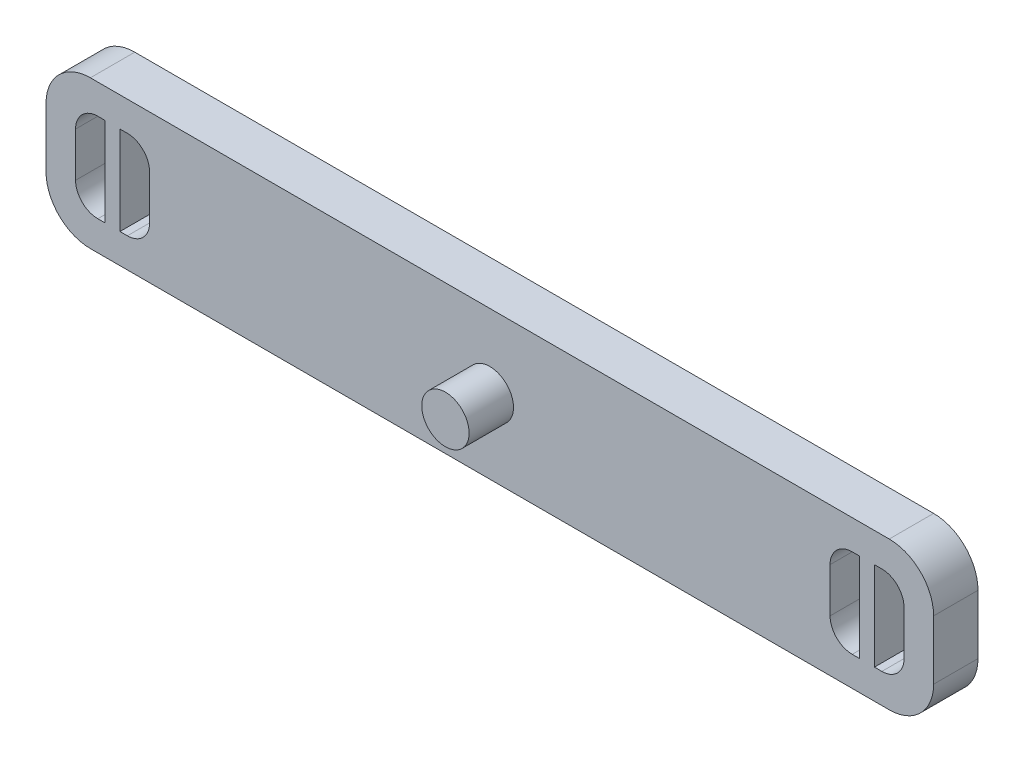
ISO-10303-21;
HEADER;
FILE_DESCRIPTION(('STEP AP214'),'2;1');
FILE_NAME('part.step','',(''),(''),'','','');
FILE_SCHEMA(('AUTOMOTIVE_DESIGN { 1 0 10303 214 1 1 1 1 }'));
ENDSEC;
DATA;
#1=APPLICATION_CONTEXT('core data for automotive mechanical design processes');
#2=APPLICATION_PROTOCOL_DEFINITION('international standard','automotive_design',2000,#1);
#3=PRODUCT_CONTEXT('',#1,'mechanical');
#4=PRODUCT('Part','Part','',(#3));
#5=PRODUCT_RELATED_PRODUCT_CATEGORY('part','',(#4));
#6=PRODUCT_DEFINITION_FORMATION('','',#4);
#7=PRODUCT_DEFINITION_CONTEXT('part definition',#1,'design');
#8=PRODUCT_DEFINITION('design','',#6,#7);
#9=PRODUCT_DEFINITION_SHAPE('','',#8);
#10=(LENGTH_UNIT() NAMED_UNIT(*) SI_UNIT(.MILLI.,.METRE.));
#11=(NAMED_UNIT(*) PLANE_ANGLE_UNIT() SI_UNIT($,.RADIAN.));
#12=(NAMED_UNIT(*) SI_UNIT($,.STERADIAN.) SOLID_ANGLE_UNIT());
#13=UNCERTAINTY_MEASURE_WITH_UNIT(LENGTH_MEASURE(1.E-05),#10,'distance_accuracy_value','');
#14=(GEOMETRIC_REPRESENTATION_CONTEXT(3) GLOBAL_UNCERTAINTY_ASSIGNED_CONTEXT((#13)) GLOBAL_UNIT_ASSIGNED_CONTEXT((#10,
#11,#12)) REPRESENTATION_CONTEXT('',''));
#15=CARTESIAN_POINT('',(0.,0.,0.));
#16=DIRECTION('',(0.,0.,1.));
#17=DIRECTION('',(1.,0.,0.));
#18=AXIS2_PLACEMENT_3D('',#15,#16,#17);
#19=CARTESIAN_POINT('',(0.,0.,3.));
#20=DIRECTION('',(0.,0.,1.));
#21=DIRECTION('',(1.,0.,0.));
#22=AXIS2_PLACEMENT_3D('',#19,#20,#21);
#23=PLANE('',#22);
#24=CARTESIAN_POINT('',(0.,0.,3.));
#25=DIRECTION('',(0.,0.,1.));
#26=DIRECTION('',(1.,0.,0.));
#27=AXIS2_PLACEMENT_3D('',#24,#25,#26);
#28=CIRCLE('',#27,1.6);
#29=CARTESIAN_POINT('',(1.6,0.,3.));
#30=VERTEX_POINT('',#29);
#31=EDGE_CURVE('E290',#30,#30,#28,.T.);
#32=ORIENTED_EDGE('',*,*,#31,.F.);
#33=EDGE_LOOP('',(#32));
#34=FACE_BOUND('',#33,.T.);
#35=DIRECTION('',(0.,1.,0.));
#36=VECTOR('',#35,1.);
#37=CARTESIAN_POINT('',(-26.,3.,3.));
#38=LINE('',#37,#36);
#39=CARTESIAN_POINT('',(-26.,-3.,3.));
#40=VERTEX_POINT('',#39);
#41=CARTESIAN_POINT('',(-26.,3.,3.));
#42=VERTEX_POINT('',#41);
#43=EDGE_CURVE('E424',#40,#42,#38,.T.);
#44=ORIENTED_EDGE('',*,*,#43,.F.);
#45=DIRECTION('',(1.,0.,0.));
#46=VECTOR('',#45,1.);
#47=CARTESIAN_POINT('',(-26.5,-3.,3.));
#48=LINE('',#47,#46);
#49=CARTESIAN_POINT('',(-26.5,-3.,3.));
#50=VERTEX_POINT('',#49);
#51=EDGE_CURVE('E403',#50,#40,#48,.T.);
#52=ORIENTED_EDGE('',*,*,#51,.F.);
#53=CARTESIAN_POINT('',(-26.5,-1.5,3.));
#54=DIRECTION('',(0.,0.,1.));
#55=DIRECTION('',(1.,0.,0.));
#56=AXIS2_PLACEMENT_3D('',#53,#54,#55);
#57=CIRCLE('',#56,1.5);
#58=CARTESIAN_POINT('',(-28.,-1.49999999999999,3.));
#59=VERTEX_POINT('',#58);
#60=EDGE_CURVE('E440',#59,#50,#57,.T.);
#61=ORIENTED_EDGE('',*,*,#60,.F.);
#62=DIRECTION('',(0.,-1.,0.));
#63=VECTOR('',#62,1.);
#64=CARTESIAN_POINT('',(-28.,1.49999999999999,3.));
#65=LINE('',#64,#63);
#66=CARTESIAN_POINT('',(-28.,1.49999999999999,3.));
#67=VERTEX_POINT('',#66);
#68=EDGE_CURVE('E436',#67,#59,#65,.T.);
#69=ORIENTED_EDGE('',*,*,#68,.F.);
#70=CARTESIAN_POINT('',(-26.5,1.5,3.));
#71=DIRECTION('',(0.,0.,1.));
#72=DIRECTION('',(1.,0.,0.));
#73=AXIS2_PLACEMENT_3D('',#70,#71,#72);
#74=CIRCLE('',#73,1.5);
#75=CARTESIAN_POINT('',(-26.5,3.,3.));
#76=VERTEX_POINT('',#75);
#77=EDGE_CURVE('E432',#76,#67,#74,.T.);
#78=ORIENTED_EDGE('',*,*,#77,.F.);
#79=DIRECTION('',(-1.,0.,0.));
#80=VECTOR('',#79,1.);
#81=CARTESIAN_POINT('',(-26.5,3.,3.));
#82=LINE('',#81,#80);
#83=EDGE_CURVE('E427',#42,#76,#82,.T.);
#84=ORIENTED_EDGE('',*,*,#83,.F.);
#85=EDGE_LOOP('',(#44,#52,#61,#69,#78,#84));
#86=FACE_BOUND('',#85,.T.);
#87=DIRECTION('',(0.,-1.,0.));
#88=VECTOR('',#87,1.);
#89=CARTESIAN_POINT('',(-25.,3.,3.));
#90=LINE('',#89,#88);
#91=CARTESIAN_POINT('',(-25.,3.,3.));
#92=VERTEX_POINT('',#91);
#93=CARTESIAN_POINT('',(-25.,-3.,3.));
#94=VERTEX_POINT('',#93);
#95=EDGE_CURVE('E428',#92,#94,#90,.T.);
#96=ORIENTED_EDGE('',*,*,#95,.F.);
#97=DIRECTION('',(-1.,0.,0.));
#98=VECTOR('',#97,1.);
#99=CARTESIAN_POINT('',(-25.,3.,3.));
#100=LINE('',#99,#98);
#101=CARTESIAN_POINT('',(-24.5,3.,3.));
#102=VERTEX_POINT('',#101);
#103=EDGE_CURVE('E485',#102,#92,#100,.T.);
#104=ORIENTED_EDGE('',*,*,#103,.F.);
#105=CARTESIAN_POINT('',(-24.5,1.5,3.));
#106=DIRECTION('',(0.,0.,1.));
#107=DIRECTION('',(-1.,0.,0.));
#108=AXIS2_PLACEMENT_3D('',#105,#106,#107);
#109=CIRCLE('',#108,1.5);
#110=CARTESIAN_POINT('',(-23.,1.49999999999999,3.));
#111=VERTEX_POINT('',#110);
#112=EDGE_CURVE('E489',#111,#102,#109,.T.);
#113=ORIENTED_EDGE('',*,*,#112,.F.);
#114=DIRECTION('',(0.,1.,0.));
#115=VECTOR('',#114,1.);
#116=CARTESIAN_POINT('',(-23.,1.49999999999999,3.));
#117=LINE('',#116,#115);
#118=CARTESIAN_POINT('',(-23.,-1.49999999999999,3.));
#119=VERTEX_POINT('',#118);
#120=EDGE_CURVE('E494',#119,#111,#117,.T.);
#121=ORIENTED_EDGE('',*,*,#120,.F.);
#122=CARTESIAN_POINT('',(-24.5,-1.5,3.));
#123=DIRECTION('',(0.,0.,1.));
#124=DIRECTION('',(1.,0.,0.));
#125=AXIS2_PLACEMENT_3D('',#122,#123,#124);
#126=CIRCLE('',#125,1.5);
#127=CARTESIAN_POINT('',(-24.5,-3.,3.));
#128=VERTEX_POINT('',#127);
#129=EDGE_CURVE('E498',#128,#119,#126,.T.);
#130=ORIENTED_EDGE('',*,*,#129,.F.);
#131=DIRECTION('',(1.,0.,0.));
#132=VECTOR('',#131,1.);
#133=CARTESIAN_POINT('',(-25.,-3.,3.));
#134=LINE('',#133,#132);
#135=EDGE_CURVE('E502',#94,#128,#134,.T.);
#136=ORIENTED_EDGE('',*,*,#135,.F.);
#137=EDGE_LOOP('',(#96,#104,#113,#121,#130,#136));
#138=FACE_BOUND('',#137,.T.);
#139=DIRECTION('',(0.,-1.,0.));
#140=VECTOR('',#139,1.);
#141=CARTESIAN_POINT('',(-30.,5.,3.));
#142=LINE('',#141,#140);
#143=CARTESIAN_POINT('',(-30.,2.,3.));
#144=VERTEX_POINT('',#143);
#145=CARTESIAN_POINT('',(-30.,-2.,3.));
#146=VERTEX_POINT('',#145);
#147=EDGE_CURVE('E537',#144,#146,#142,.T.);
#148=ORIENTED_EDGE('',*,*,#147,.T.);
#149=CARTESIAN_POINT('',(-27.,-2.,3.));
#150=DIRECTION('',(0.,0.,1.));
#151=DIRECTION('',(1.,0.,0.));
#152=AXIS2_PLACEMENT_3D('',#149,#150,#151);
#153=CIRCLE('',#152,3.);
#154=CARTESIAN_POINT('',(-27.,-5.,3.));
#155=VERTEX_POINT('',#154);
#156=EDGE_CURVE('E592',#146,#155,#153,.T.);
#157=ORIENTED_EDGE('',*,*,#156,.T.);
#158=DIRECTION('',(1.,0.,0.));
#159=VECTOR('',#158,1.);
#160=CARTESIAN_POINT('',(-30.,-5.,3.));
#161=LINE('',#160,#159);
#162=CARTESIAN_POINT('',(27.,-5.,3.));
#163=VERTEX_POINT('',#162);
#164=EDGE_CURVE('E541',#155,#163,#161,.T.);
#165=ORIENTED_EDGE('',*,*,#164,.T.);
#166=CARTESIAN_POINT('',(27.,-2.,3.));
#167=DIRECTION('',(0.,0.,1.));
#168=DIRECTION('',(1.,0.,0.));
#169=AXIS2_PLACEMENT_3D('',#166,#167,#168);
#170=CIRCLE('',#169,3.);
#171=CARTESIAN_POINT('',(30.,-2.,3.));
#172=VERTEX_POINT('',#171);
#173=EDGE_CURVE('E586',#163,#172,#170,.T.);
#174=ORIENTED_EDGE('',*,*,#173,.T.);
#175=DIRECTION('',(0.,1.,0.));
#176=VECTOR('',#175,1.);
#177=CARTESIAN_POINT('',(30.,5.,3.));
#178=LINE('',#177,#176);
#179=CARTESIAN_POINT('',(30.,2.,3.));
#180=VERTEX_POINT('',#179);
#181=EDGE_CURVE('E530',#172,#180,#178,.T.);
#182=ORIENTED_EDGE('',*,*,#181,.T.);
#183=CARTESIAN_POINT('',(27.,2.,3.));
#184=DIRECTION('',(0.,0.,1.));
#185=DIRECTION('',(1.,0.,0.));
#186=AXIS2_PLACEMENT_3D('',#183,#184,#185);
#187=CIRCLE('',#186,3.);
#188=CARTESIAN_POINT('',(27.,5.,3.));
#189=VERTEX_POINT('',#188);
#190=EDGE_CURVE('E66',#180,#189,#187,.T.);
#191=ORIENTED_EDGE('',*,*,#190,.T.);
#192=DIRECTION('',(-1.,0.,0.));
#193=VECTOR('',#192,1.);
#194=CARTESIAN_POINT('',(-30.,5.,3.));
#195=LINE('',#194,#193);
#196=CARTESIAN_POINT('',(-27.,5.,3.));
#197=VERTEX_POINT('',#196);
#198=EDGE_CURVE('E533',#189,#197,#195,.T.);
#199=ORIENTED_EDGE('',*,*,#198,.T.);
#200=CARTESIAN_POINT('',(-27.,2.,3.));
#201=DIRECTION('',(0.,0.,1.));
#202=DIRECTION('',(1.,0.,0.));
#203=AXIS2_PLACEMENT_3D('',#200,#201,#202);
#204=CIRCLE('',#203,3.);
#205=EDGE_CURVE('E589',#197,#144,#204,.T.);
#206=ORIENTED_EDGE('',*,*,#205,.T.);
#207=EDGE_LOOP('',(#148,#157,#165,#174,#182,#191,#199,#206));
#208=FACE_BOUND('',#207,.T.);
#209=DIRECTION('',(1.,0.,0.));
#210=VECTOR('',#209,1.);
#211=CARTESIAN_POINT('',(25.,3.,3.));
#212=LINE('',#211,#210);
#213=CARTESIAN_POINT('',(24.5,3.,3.));
#214=VERTEX_POINT('',#213);
#215=CARTESIAN_POINT('',(25.,3.,3.));
#216=VERTEX_POINT('',#215);
#217=EDGE_CURVE('E360',#214,#216,#212,.T.);
#218=ORIENTED_EDGE('',*,*,#217,.T.);
#219=DIRECTION('',(0.,-1.,0.));
#220=VECTOR('',#219,1.);
#221=CARTESIAN_POINT('',(25.,3.,3.));
#222=LINE('',#221,#220);
#223=CARTESIAN_POINT('',(25.,-3.,3.));
#224=VERTEX_POINT('',#223);
#225=EDGE_CURVE('E356',#216,#224,#222,.T.);
#226=ORIENTED_EDGE('',*,*,#225,.T.);
#227=DIRECTION('',(-1.,0.,0.));
#228=VECTOR('',#227,1.);
#229=CARTESIAN_POINT('',(25.,-3.,3.));
#230=LINE('',#229,#228);
#231=CARTESIAN_POINT('',(24.5,-3.,3.));
#232=VERTEX_POINT('',#231);
#233=EDGE_CURVE('E339',#224,#232,#230,.T.);
#234=ORIENTED_EDGE('',*,*,#233,.T.);
#235=CARTESIAN_POINT('',(24.5,-1.5,3.));
#236=DIRECTION('',(0.,0.,-1.));
#237=DIRECTION('',(-1.,0.,0.));
#238=AXIS2_PLACEMENT_3D('',#235,#236,#237);
#239=CIRCLE('',#238,1.5);
#240=CARTESIAN_POINT('',(23.,-1.49999999999999,3.));
#241=VERTEX_POINT('',#240);
#242=EDGE_CURVE('E373',#232,#241,#239,.T.);
#243=ORIENTED_EDGE('',*,*,#242,.T.);
#244=DIRECTION('',(0.,1.,0.));
#245=VECTOR('',#244,1.);
#246=CARTESIAN_POINT('',(23.,1.49999999999999,3.));
#247=LINE('',#246,#245);
#248=CARTESIAN_POINT('',(23.,1.49999999999999,3.));
#249=VERTEX_POINT('',#248);
#250=EDGE_CURVE('E369',#241,#249,#247,.T.);
#251=ORIENTED_EDGE('',*,*,#250,.T.);
#252=CARTESIAN_POINT('',(24.5,1.5,3.));
#253=DIRECTION('',(0.,0.,-1.));
#254=DIRECTION('',(1.,0.,0.));
#255=AXIS2_PLACEMENT_3D('',#252,#253,#254);
#256=CIRCLE('',#255,1.5);
#257=EDGE_CURVE('E365',#249,#214,#256,.T.);
#258=ORIENTED_EDGE('',*,*,#257,.T.);
#259=EDGE_LOOP('',(#218,#226,#234,#243,#251,#258));
#260=FACE_BOUND('',#259,.T.);
#261=DIRECTION('',(-1.,0.,0.));
#262=VECTOR('',#261,1.);
#263=CARTESIAN_POINT('',(26.5,-3.,3.));
#264=LINE('',#263,#262);
#265=CARTESIAN_POINT('',(26.5,-3.,3.));
#266=VERTEX_POINT('',#265);
#267=CARTESIAN_POINT('',(26.,-3.,3.));
#268=VERTEX_POINT('',#267);
#269=EDGE_CURVE('E305',#266,#268,#264,.T.);
#270=ORIENTED_EDGE('',*,*,#269,.T.);
#271=DIRECTION('',(0.,1.,0.));
#272=VECTOR('',#271,1.);
#273=CARTESIAN_POINT('',(26.,3.,3.));
#274=LINE('',#273,#272);
#275=CARTESIAN_POINT('',(26.,3.,3.));
#276=VERTEX_POINT('',#275);
#277=EDGE_CURVE('E275',#268,#276,#274,.T.);
#278=ORIENTED_EDGE('',*,*,#277,.T.);
#279=DIRECTION('',(1.,0.,0.));
#280=VECTOR('',#279,1.);
#281=CARTESIAN_POINT('',(26.5,3.,3.));
#282=LINE('',#281,#280);
#283=CARTESIAN_POINT('',(26.5,3.,3.));
#284=VERTEX_POINT('',#283);
#285=EDGE_CURVE('E283',#276,#284,#282,.T.);
#286=ORIENTED_EDGE('',*,*,#285,.T.);
#287=CARTESIAN_POINT('',(26.5,1.5,3.));
#288=DIRECTION('',(0.,0.,-1.));
#289=DIRECTION('',(-1.,0.,0.));
#290=AXIS2_PLACEMENT_3D('',#287,#288,#289);
#291=CIRCLE('',#290,1.5);
#292=CARTESIAN_POINT('',(28.,1.49999999999999,3.));
#293=VERTEX_POINT('',#292);
#294=EDGE_CURVE('E287',#284,#293,#291,.T.);
#295=ORIENTED_EDGE('',*,*,#294,.T.);
#296=DIRECTION('',(0.,-1.,0.));
#297=VECTOR('',#296,1.);
#298=CARTESIAN_POINT('',(28.,1.49999999999999,3.));
#299=LINE('',#298,#297);
#300=CARTESIAN_POINT('',(28.,-1.49999999999999,3.));
#301=VERTEX_POINT('',#300);
#302=EDGE_CURVE('E313',#293,#301,#299,.T.);
#303=ORIENTED_EDGE('',*,*,#302,.T.);
#304=CARTESIAN_POINT('',(26.5,-1.5,3.));
#305=DIRECTION('',(0.,0.,-1.));
#306=DIRECTION('',(-1.,0.,0.));
#307=AXIS2_PLACEMENT_3D('',#304,#305,#306);
#308=CIRCLE('',#307,1.5);
#309=EDGE_CURVE('E309',#301,#266,#308,.T.);
#310=ORIENTED_EDGE('',*,*,#309,.T.);
#311=EDGE_LOOP('',(#270,#278,#286,#295,#303,#310));
#312=FACE_BOUND('',#311,.T.);
#313=ADVANCED_FACE('F43',(#34,#86,#138,#208,#260,#312),#23,.T.);
#314=CARTESIAN_POINT('',(0.,0.,0.));
#315=DIRECTION('',(0.,0.,1.));
#316=DIRECTION('',(1.,0.,0.));
#317=AXIS2_PLACEMENT_3D('',#314,#315,#316);
#318=PLANE('',#317);
#319=DIRECTION('',(0.,-1.,0.));
#320=VECTOR('',#319,1.);
#321=CARTESIAN_POINT('',(25.,3.,0.));
#322=LINE('',#321,#320);
#323=CARTESIAN_POINT('',(25.,3.,0.));
#324=VERTEX_POINT('',#323);
#325=CARTESIAN_POINT('',(25.,-3.,0.));
#326=VERTEX_POINT('',#325);
#327=EDGE_CURVE('E335',#324,#326,#322,.T.);
#328=ORIENTED_EDGE('',*,*,#327,.F.);
#329=DIRECTION('',(1.,0.,0.));
#330=VECTOR('',#329,1.);
#331=CARTESIAN_POINT('',(25.,3.,0.));
#332=LINE('',#331,#330);
#333=CARTESIAN_POINT('',(24.5,3.,0.));
#334=VERTEX_POINT('',#333);
#335=EDGE_CURVE('E338',#334,#324,#332,.T.);
#336=ORIENTED_EDGE('',*,*,#335,.F.);
#337=CARTESIAN_POINT('',(24.5,1.5,0.));
#338=DIRECTION('',(0.,0.,-1.));
#339=DIRECTION('',(1.,0.,0.));
#340=AXIS2_PLACEMENT_3D('',#337,#338,#339);
#341=CIRCLE('',#340,1.5);
#342=CARTESIAN_POINT('',(23.,1.49999999999999,0.));
#343=VERTEX_POINT('',#342);
#344=EDGE_CURVE('E342',#343,#334,#341,.T.);
#345=ORIENTED_EDGE('',*,*,#344,.F.);
#346=DIRECTION('',(0.,1.,0.));
#347=VECTOR('',#346,1.);
#348=CARTESIAN_POINT('',(23.,1.49999999999999,0.));
#349=LINE('',#348,#347);
#350=CARTESIAN_POINT('',(23.,-1.49999999999999,0.));
#351=VERTEX_POINT('',#350);
#352=EDGE_CURVE('E346',#351,#343,#349,.T.);
#353=ORIENTED_EDGE('',*,*,#352,.F.);
#354=CARTESIAN_POINT('',(24.5,-1.5,0.));
#355=DIRECTION('',(0.,0.,-1.));
#356=DIRECTION('',(-1.,0.,0.));
#357=AXIS2_PLACEMENT_3D('',#354,#355,#356);
#358=CIRCLE('',#357,1.5);
#359=CARTESIAN_POINT('',(24.5,-3.,0.));
#360=VERTEX_POINT('',#359);
#361=EDGE_CURVE('E349',#360,#351,#358,.T.);
#362=ORIENTED_EDGE('',*,*,#361,.F.);
#363=DIRECTION('',(-1.,0.,0.));
#364=VECTOR('',#363,1.);
#365=CARTESIAN_POINT('',(25.,-3.,0.));
#366=LINE('',#365,#364);
#367=EDGE_CURVE('E352',#326,#360,#366,.T.);
#368=ORIENTED_EDGE('',*,*,#367,.F.);
#369=EDGE_LOOP('',(#328,#336,#345,#353,#362,#368));
#370=FACE_BOUND('',#369,.T.);
#371=DIRECTION('',(1.,0.,0.));
#372=VECTOR('',#371,1.);
#373=CARTESIAN_POINT('',(-26.5,-3.,0.));
#374=LINE('',#373,#372);
#375=CARTESIAN_POINT('',(-26.5,-3.,0.));
#376=VERTEX_POINT('',#375);
#377=CARTESIAN_POINT('',(-26.,-3.,0.));
#378=VERTEX_POINT('',#377);
#379=EDGE_CURVE('E419',#376,#378,#374,.T.);
#380=ORIENTED_EDGE('',*,*,#379,.T.);
#381=DIRECTION('',(0.,1.,0.));
#382=VECTOR('',#381,1.);
#383=CARTESIAN_POINT('',(-26.,3.,0.));
#384=LINE('',#383,#382);
#385=CARTESIAN_POINT('',(-26.,3.,0.));
#386=VERTEX_POINT('',#385);
#387=EDGE_CURVE('E398',#378,#386,#384,.T.);
#388=ORIENTED_EDGE('',*,*,#387,.T.);
#389=DIRECTION('',(-1.,0.,0.));
#390=VECTOR('',#389,1.);
#391=CARTESIAN_POINT('',(-26.5,3.,0.));
#392=LINE('',#391,#390);
#393=CARTESIAN_POINT('',(-26.5,3.,0.));
#394=VERTEX_POINT('',#393);
#395=EDGE_CURVE('E402',#386,#394,#392,.T.);
#396=ORIENTED_EDGE('',*,*,#395,.T.);
#397=CARTESIAN_POINT('',(-26.5,1.5,0.));
#398=DIRECTION('',(0.,0.,1.));
#399=DIRECTION('',(1.,0.,0.));
#400=AXIS2_PLACEMENT_3D('',#397,#398,#399);
#401=CIRCLE('',#400,1.5);
#402=CARTESIAN_POINT('',(-28.,1.49999999999999,0.));
#403=VERTEX_POINT('',#402);
#404=EDGE_CURVE('E407',#394,#403,#401,.T.);
#405=ORIENTED_EDGE('',*,*,#404,.T.);
#406=DIRECTION('',(0.,-1.,0.));
#407=VECTOR('',#406,1.);
#408=CARTESIAN_POINT('',(-28.,1.49999999999999,0.));
#409=LINE('',#408,#407);
#410=CARTESIAN_POINT('',(-28.,-1.49999999999999,0.));
#411=VERTEX_POINT('',#410);
#412=EDGE_CURVE('E411',#403,#411,#409,.T.);
#413=ORIENTED_EDGE('',*,*,#412,.T.);
#414=CARTESIAN_POINT('',(-26.5,-1.5,0.));
#415=DIRECTION('',(0.,0.,1.));
#416=DIRECTION('',(1.,0.,0.));
#417=AXIS2_PLACEMENT_3D('',#414,#415,#416);
#418=CIRCLE('',#417,1.5);
#419=EDGE_CURVE('E415',#411,#376,#418,.T.);
#420=ORIENTED_EDGE('',*,*,#419,.T.);
#421=EDGE_LOOP('',(#380,#388,#396,#405,#413,#420));
#422=FACE_BOUND('',#421,.T.);
#423=DIRECTION('',(-1.,0.,0.));
#424=VECTOR('',#423,1.);
#425=CARTESIAN_POINT('',(-25.,3.,0.));
#426=LINE('',#425,#424);
#427=CARTESIAN_POINT('',(-24.5,3.,0.));
#428=VERTEX_POINT('',#427);
#429=CARTESIAN_POINT('',(-25.,3.,0.));
#430=VERTEX_POINT('',#429);
#431=EDGE_CURVE('E470',#428,#430,#426,.T.);
#432=ORIENTED_EDGE('',*,*,#431,.T.);
#433=DIRECTION('',(0.,-1.,0.));
#434=VECTOR('',#433,1.);
#435=CARTESIAN_POINT('',(-25.,3.,0.));
#436=LINE('',#435,#434);
#437=CARTESIAN_POINT('',(-25.,-3.,0.));
#438=VERTEX_POINT('',#437);
#439=EDGE_CURVE('E490',#430,#438,#436,.T.);
#440=ORIENTED_EDGE('',*,*,#439,.T.);
#441=DIRECTION('',(1.,0.,0.));
#442=VECTOR('',#441,1.);
#443=CARTESIAN_POINT('',(-25.,-3.,0.));
#444=LINE('',#443,#442);
#445=CARTESIAN_POINT('',(-24.5,-3.,0.));
#446=VERTEX_POINT('',#445);
#447=EDGE_CURVE('E523',#438,#446,#444,.T.);
#448=ORIENTED_EDGE('',*,*,#447,.T.);
#449=CARTESIAN_POINT('',(-24.5,-1.5,0.));
#450=DIRECTION('',(0.,0.,1.));
#451=DIRECTION('',(1.,0.,0.));
#452=AXIS2_PLACEMENT_3D('',#449,#450,#451);
#453=CIRCLE('',#452,1.5);
#454=CARTESIAN_POINT('',(-23.,-1.49999999999999,0.));
#455=VERTEX_POINT('',#454);
#456=EDGE_CURVE('E519',#446,#455,#453,.T.);
#457=ORIENTED_EDGE('',*,*,#456,.T.);
#458=DIRECTION('',(0.,1.,0.));
#459=VECTOR('',#458,1.);
#460=CARTESIAN_POINT('',(-23.,1.49999999999999,0.));
#461=LINE('',#460,#459);
#462=CARTESIAN_POINT('',(-23.,1.49999999999999,0.));
#463=VERTEX_POINT('',#462);
#464=EDGE_CURVE('E515',#455,#463,#461,.T.);
#465=ORIENTED_EDGE('',*,*,#464,.T.);
#466=CARTESIAN_POINT('',(-24.5,1.5,0.));
#467=DIRECTION('',(0.,0.,1.));
#468=DIRECTION('',(-1.,0.,0.));
#469=AXIS2_PLACEMENT_3D('',#466,#467,#468);
#470=CIRCLE('',#469,1.5);
#471=EDGE_CURVE('E511',#463,#428,#470,.T.);
#472=ORIENTED_EDGE('',*,*,#471,.T.);
#473=EDGE_LOOP('',(#432,#440,#448,#457,#465,#472));
#474=FACE_BOUND('',#473,.T.);
#475=DIRECTION('',(1.,0.,0.));
#476=VECTOR('',#475,1.);
#477=CARTESIAN_POINT('',(-30.,-5.,0.));
#478=LINE('',#477,#476);
#479=CARTESIAN_POINT('',(-27.,-5.,0.));
#480=VERTEX_POINT('',#479);
#481=CARTESIAN_POINT('',(27.,-5.,0.));
#482=VERTEX_POINT('',#481);
#483=EDGE_CURVE('E534',#480,#482,#478,.T.);
#484=ORIENTED_EDGE('',*,*,#483,.F.);
#485=CARTESIAN_POINT('',(-27.,-2.,0.));
#486=DIRECTION('',(0.,0.,1.));
#487=DIRECTION('',(1.,0.,0.));
#488=AXIS2_PLACEMENT_3D('',#485,#486,#487);
#489=CIRCLE('',#488,3.);
#490=CARTESIAN_POINT('',(-30.,-2.,0.));
#491=VERTEX_POINT('',#490);
#492=EDGE_CURVE('E574',#480,#491,#489,.F.);
#493=ORIENTED_EDGE('',*,*,#492,.T.);
#494=DIRECTION('',(0.,-1.,0.));
#495=VECTOR('',#494,1.);
#496=CARTESIAN_POINT('',(-30.,5.,0.));
#497=LINE('',#496,#495);
#498=CARTESIAN_POINT('',(-30.,2.,0.));
#499=VERTEX_POINT('',#498);
#500=EDGE_CURVE('E552',#499,#491,#497,.T.);
#501=ORIENTED_EDGE('',*,*,#500,.F.);
#502=CARTESIAN_POINT('',(-27.,2.,0.));
#503=DIRECTION('',(0.,0.,1.));
#504=DIRECTION('',(1.,0.,0.));
#505=AXIS2_PLACEMENT_3D('',#502,#503,#504);
#506=CIRCLE('',#505,3.);
#507=CARTESIAN_POINT('',(-27.,5.,0.));
#508=VERTEX_POINT('',#507);
#509=EDGE_CURVE('E571',#499,#508,#506,.F.);
#510=ORIENTED_EDGE('',*,*,#509,.T.);
#511=DIRECTION('',(-1.,0.,0.));
#512=VECTOR('',#511,1.);
#513=CARTESIAN_POINT('',(-30.,5.,0.));
#514=LINE('',#513,#512);
#515=CARTESIAN_POINT('',(27.,5.,0.));
#516=VERTEX_POINT('',#515);
#517=EDGE_CURVE('E549',#516,#508,#514,.T.);
#518=ORIENTED_EDGE('',*,*,#517,.F.);
#519=CARTESIAN_POINT('',(27.,2.,0.));
#520=DIRECTION('',(0.,0.,1.));
#521=DIRECTION('',(1.,0.,0.));
#522=AXIS2_PLACEMENT_3D('',#519,#520,#521);
#523=CIRCLE('',#522,3.);
#524=CARTESIAN_POINT('',(30.,2.,0.));
#525=VERTEX_POINT('',#524);
#526=EDGE_CURVE('E565',#516,#525,#523,.F.);
#527=ORIENTED_EDGE('',*,*,#526,.T.);
#528=DIRECTION('',(0.,1.,0.));
#529=VECTOR('',#528,1.);
#530=CARTESIAN_POINT('',(30.,5.,0.));
#531=LINE('',#530,#529);
#532=CARTESIAN_POINT('',(30.,-2.,0.));
#533=VERTEX_POINT('',#532);
#534=EDGE_CURVE('E450',#533,#525,#531,.T.);
#535=ORIENTED_EDGE('',*,*,#534,.F.);
#536=CARTESIAN_POINT('',(27.,-2.,0.));
#537=DIRECTION('',(0.,0.,1.));
#538=DIRECTION('',(1.,0.,0.));
#539=AXIS2_PLACEMENT_3D('',#536,#537,#538);
#540=CIRCLE('',#539,3.);
#541=EDGE_CURVE('E568',#533,#482,#540,.F.);
#542=ORIENTED_EDGE('',*,*,#541,.T.);
#543=EDGE_LOOP('',(#484,#493,#501,#510,#518,#527,#535,#542));
#544=FACE_BOUND('',#543,.T.);
#545=DIRECTION('',(0.,1.,0.));
#546=VECTOR('',#545,1.);
#547=CARTESIAN_POINT('',(26.,3.,0.));
#548=LINE('',#547,#546);
#549=CARTESIAN_POINT('',(26.,-3.,0.));
#550=VERTEX_POINT('',#549);
#551=CARTESIAN_POINT('',(26.,3.,0.));
#552=VERTEX_POINT('',#551);
#553=EDGE_CURVE('E268',#550,#552,#548,.T.);
#554=ORIENTED_EDGE('',*,*,#553,.F.);
#555=DIRECTION('',(-1.,0.,0.));
#556=VECTOR('',#555,1.);
#557=CARTESIAN_POINT('',(26.5,-3.,0.));
#558=LINE('',#557,#556);
#559=CARTESIAN_POINT('',(26.5,-3.,0.));
#560=VERTEX_POINT('',#559);
#561=EDGE_CURVE('E255',#560,#550,#558,.T.);
#562=ORIENTED_EDGE('',*,*,#561,.F.);
#563=CARTESIAN_POINT('',(26.5,-1.5,0.));
#564=DIRECTION('',(0.,0.,-1.));
#565=DIRECTION('',(-1.,0.,0.));
#566=AXIS2_PLACEMENT_3D('',#563,#564,#565);
#567=CIRCLE('',#566,1.5);
#568=CARTESIAN_POINT('',(28.,-1.49999999999999,0.));
#569=VERTEX_POINT('',#568);
#570=EDGE_CURVE('E267',#569,#560,#567,.T.);
#571=ORIENTED_EDGE('',*,*,#570,.F.);
#572=DIRECTION('',(0.,-1.,0.));
#573=VECTOR('',#572,1.);
#574=CARTESIAN_POINT('',(28.,1.49999999999999,0.));
#575=LINE('',#574,#573);
#576=CARTESIAN_POINT('',(28.,1.49999999999999,0.));
#577=VERTEX_POINT('',#576);
#578=EDGE_CURVE('E295',#577,#569,#575,.T.);
#579=ORIENTED_EDGE('',*,*,#578,.F.);
#580=CARTESIAN_POINT('',(26.5,1.5,0.));
#581=DIRECTION('',(0.,0.,-1.));
#582=DIRECTION('',(-1.,0.,0.));
#583=AXIS2_PLACEMENT_3D('',#580,#581,#582);
#584=CIRCLE('',#583,1.5);
#585=CARTESIAN_POINT('',(26.5,3.,0.));
#586=VERTEX_POINT('',#585);
#587=EDGE_CURVE('E298',#586,#577,#584,.T.);
#588=ORIENTED_EDGE('',*,*,#587,.F.);
#589=DIRECTION('',(1.,0.,0.));
#590=VECTOR('',#589,1.);
#591=CARTESIAN_POINT('',(26.5,3.,0.));
#592=LINE('',#591,#590);
#593=EDGE_CURVE('E277',#552,#586,#592,.T.);
#594=ORIENTED_EDGE('',*,*,#593,.F.);
#595=EDGE_LOOP('',(#554,#562,#571,#579,#588,#594));
#596=FACE_BOUND('',#595,.T.);
#597=ADVANCED_FACE('F280',(#370,#422,#474,#544,#596),#318,.F.);
#598=CARTESIAN_POINT('',(30.,5.,3.));
#599=DIRECTION('',(-1.,0.,0.));
#600=DIRECTION('',(0.,0.,1.));
#601=AXIS2_PLACEMENT_3D('',#598,#599,#600);
#602=PLANE('',#601);
#603=ORIENTED_EDGE('',*,*,#181,.F.);
#604=DIRECTION('',(0.,0.,-1.));
#605=VECTOR('',#604,1.);
#606=CARTESIAN_POINT('',(30.,-2.,3.));
#607=LINE('',#606,#605);
#608=EDGE_CURVE('E11',#172,#533,#607,.T.);
#609=ORIENTED_EDGE('',*,*,#608,.T.);
#610=ORIENTED_EDGE('',*,*,#534,.T.);
#611=DIRECTION('',(0.,0.,-1.));
#612=VECTOR('',#611,1.);
#613=CARTESIAN_POINT('',(30.,2.,3.));
#614=LINE('',#613,#612);
#615=EDGE_CURVE('E52',#525,#180,#614,.F.);
#616=ORIENTED_EDGE('',*,*,#615,.T.);
#617=EDGE_LOOP('',(#603,#609,#610,#616));
#618=FACE_BOUND('',#617,.T.);
#619=ADVANCED_FACE('F604',(#618),#602,.F.);
#620=CARTESIAN_POINT('',(-30.,5.,3.));
#621=DIRECTION('',(0.,-1.,0.));
#622=DIRECTION('',(0.,0.,-1.));
#623=AXIS2_PLACEMENT_3D('',#620,#621,#622);
#624=PLANE('',#623);
#625=ORIENTED_EDGE('',*,*,#517,.T.);
#626=DIRECTION('',(0.,0.,-1.));
#627=VECTOR('',#626,1.);
#628=CARTESIAN_POINT('',(-27.,5.,3.));
#629=LINE('',#628,#627);
#630=EDGE_CURVE('E59',#508,#197,#629,.F.);
#631=ORIENTED_EDGE('',*,*,#630,.T.);
#632=ORIENTED_EDGE('',*,*,#198,.F.);
#633=DIRECTION('',(0.,0.,-1.));
#634=VECTOR('',#633,1.);
#635=CARTESIAN_POINT('',(27.,5.,3.));
#636=LINE('',#635,#634);
#637=EDGE_CURVE('E595',#189,#516,#636,.T.);
#638=ORIENTED_EDGE('',*,*,#637,.T.);
#639=EDGE_LOOP('',(#625,#631,#632,#638));
#640=FACE_BOUND('',#639,.T.);
#641=ADVANCED_FACE('F612',(#640),#624,.F.);
#642=CARTESIAN_POINT('',(-30.,5.,3.));
#643=DIRECTION('',(1.,0.,0.));
#644=DIRECTION('',(0.,0.,-1.));
#645=AXIS2_PLACEMENT_3D('',#642,#643,#644);
#646=PLANE('',#645);
#647=ORIENTED_EDGE('',*,*,#500,.T.);
#648=DIRECTION('',(0.,0.,-1.));
#649=VECTOR('',#648,1.);
#650=CARTESIAN_POINT('',(-30.,-2.,3.));
#651=LINE('',#650,#649);
#652=EDGE_CURVE('E581',#491,#146,#651,.F.);
#653=ORIENTED_EDGE('',*,*,#652,.T.);
#654=ORIENTED_EDGE('',*,*,#147,.F.);
#655=DIRECTION('',(0.,0.,-1.));
#656=VECTOR('',#655,1.);
#657=CARTESIAN_POINT('',(-30.,2.,3.));
#658=LINE('',#657,#656);
#659=EDGE_CURVE('E577',#144,#499,#658,.T.);
#660=ORIENTED_EDGE('',*,*,#659,.T.);
#661=EDGE_LOOP('',(#647,#653,#654,#660));
#662=FACE_BOUND('',#661,.T.);
#663=ADVANCED_FACE('F622',(#662),#646,.F.);
#664=CARTESIAN_POINT('',(-30.,-5.,3.));
#665=DIRECTION('',(0.,1.,0.));
#666=DIRECTION('',(0.,0.,1.));
#667=AXIS2_PLACEMENT_3D('',#664,#665,#666);
#668=PLANE('',#667);
#669=ORIENTED_EDGE('',*,*,#164,.F.);
#670=DIRECTION('',(0.,0.,-1.));
#671=VECTOR('',#670,1.);
#672=CARTESIAN_POINT('',(-27.,-5.,3.));
#673=LINE('',#672,#671);
#674=EDGE_CURVE('E561',#155,#480,#673,.T.);
#675=ORIENTED_EDGE('',*,*,#674,.T.);
#676=ORIENTED_EDGE('',*,*,#483,.T.);
#677=DIRECTION('',(0.,0.,-1.));
#678=VECTOR('',#677,1.);
#679=CARTESIAN_POINT('',(27.,-5.,3.));
#680=LINE('',#679,#678);
#681=EDGE_CURVE('E545',#482,#163,#680,.F.);
#682=ORIENTED_EDGE('',*,*,#681,.T.);
#683=EDGE_LOOP('',(#669,#675,#676,#682));
#684=FACE_BOUND('',#683,.T.);
#685=ADVANCED_FACE('F630',(#684),#668,.F.);
#686=CARTESIAN_POINT('',(-25.,3.,0.));
#687=DIRECTION('',(-1.,0.,0.));
#688=DIRECTION('',(0.,0.,1.));
#689=AXIS2_PLACEMENT_3D('',#686,#687,#688);
#690=PLANE('',#689);
#691=ORIENTED_EDGE('',*,*,#95,.T.);
#692=DIRECTION('',(0.,0.,1.));
#693=VECTOR('',#692,1.);
#694=CARTESIAN_POINT('',(-25.,-3.,0.));
#695=LINE('',#694,#693);
#696=EDGE_CURVE('E466',#438,#94,#695,.T.);
#697=ORIENTED_EDGE('',*,*,#696,.F.);
#698=ORIENTED_EDGE('',*,*,#439,.F.);
#699=DIRECTION('',(0.,0.,1.));
#700=VECTOR('',#699,1.);
#701=CARTESIAN_POINT('',(-25.,3.,0.));
#702=LINE('',#701,#700);
#703=EDGE_CURVE('E323',#430,#92,#702,.T.);
#704=ORIENTED_EDGE('',*,*,#703,.T.);
#705=EDGE_LOOP('',(#691,#697,#698,#704));
#706=FACE_BOUND('',#705,.T.);
#707=ADVANCED_FACE('F657',(#706),#690,.F.);
#708=CARTESIAN_POINT('',(-25.,3.,0.));
#709=DIRECTION('',(0.,1.,0.));
#710=DIRECTION('',(0.,0.,1.));
#711=AXIS2_PLACEMENT_3D('',#708,#709,#710);
#712=PLANE('',#711);
#713=ORIENTED_EDGE('',*,*,#103,.T.);
#714=ORIENTED_EDGE('',*,*,#703,.F.);
#715=ORIENTED_EDGE('',*,*,#431,.F.);
#716=DIRECTION('',(0.,0.,1.));
#717=VECTOR('',#716,1.);
#718=CARTESIAN_POINT('',(-24.5,3.,0.));
#719=LINE('',#718,#717);
#720=EDGE_CURVE('E480',#428,#102,#719,.T.);
#721=ORIENTED_EDGE('',*,*,#720,.T.);
#722=EDGE_LOOP('',(#713,#714,#715,#721));
#723=FACE_BOUND('',#722,.T.);
#724=ADVANCED_FACE('F652',(#723),#712,.F.);
#725=CARTESIAN_POINT('',(-24.5,1.5,0.));
#726=DIRECTION('',(0.,0.,1.));
#727=DIRECTION('',(1.,0.,0.));
#728=AXIS2_PLACEMENT_3D('',#725,#726,#727);
#729=CYLINDRICAL_SURFACE('',#728,1.5);
#730=ORIENTED_EDGE('',*,*,#112,.T.);
#731=ORIENTED_EDGE('',*,*,#720,.F.);
#732=ORIENTED_EDGE('',*,*,#471,.F.);
#733=DIRECTION('',(0.,0.,1.));
#734=VECTOR('',#733,1.);
#735=CARTESIAN_POINT('',(-23.,1.49999999999999,0.));
#736=LINE('',#735,#734);
#737=EDGE_CURVE('E477',#463,#111,#736,.T.);
#738=ORIENTED_EDGE('',*,*,#737,.T.);
#739=EDGE_LOOP('',(#730,#731,#732,#738));
#740=FACE_BOUND('',#739,.T.);
#741=ADVANCED_FACE('F742',(#740),#729,.F.);
#742=CARTESIAN_POINT('',(-23.,1.49999999999999,0.));
#743=DIRECTION('',(1.,0.,0.));
#744=DIRECTION('',(0.,0.,-1.));
#745=AXIS2_PLACEMENT_3D('',#742,#743,#744);
#746=PLANE('',#745);
#747=ORIENTED_EDGE('',*,*,#120,.T.);
#748=ORIENTED_EDGE('',*,*,#737,.F.);
#749=ORIENTED_EDGE('',*,*,#464,.F.);
#750=DIRECTION('',(0.,0.,1.));
#751=VECTOR('',#750,1.);
#752=CARTESIAN_POINT('',(-23.,-1.49999999999999,0.));
#753=LINE('',#752,#751);
#754=EDGE_CURVE('E474',#455,#119,#753,.T.);
#755=ORIENTED_EDGE('',*,*,#754,.T.);
#756=EDGE_LOOP('',(#747,#748,#749,#755));
#757=FACE_BOUND('',#756,.T.);
#758=ADVANCED_FACE('F739',(#757),#746,.F.);
#759=CARTESIAN_POINT('',(-24.5,-1.5,0.));
#760=DIRECTION('',(0.,0.,1.));
#761=DIRECTION('',(1.,0.,0.));
#762=AXIS2_PLACEMENT_3D('',#759,#760,#761);
#763=CYLINDRICAL_SURFACE('',#762,1.5);
#764=ORIENTED_EDGE('',*,*,#129,.T.);
#765=ORIENTED_EDGE('',*,*,#754,.F.);
#766=ORIENTED_EDGE('',*,*,#456,.F.);
#767=DIRECTION('',(0.,0.,1.));
#768=VECTOR('',#767,1.);
#769=CARTESIAN_POINT('',(-24.5,-3.,0.));
#770=LINE('',#769,#768);
#771=EDGE_CURVE('E471',#446,#128,#770,.T.);
#772=ORIENTED_EDGE('',*,*,#771,.T.);
#773=EDGE_LOOP('',(#764,#765,#766,#772));
#774=FACE_BOUND('',#773,.T.);
#775=ADVANCED_FACE('F735',(#774),#763,.F.);
#776=CARTESIAN_POINT('',(-25.,-3.,0.));
#777=DIRECTION('',(0.,-1.,0.));
#778=DIRECTION('',(0.,0.,-1.));
#779=AXIS2_PLACEMENT_3D('',#776,#777,#778);
#780=PLANE('',#779);
#781=ORIENTED_EDGE('',*,*,#135,.T.);
#782=ORIENTED_EDGE('',*,*,#771,.F.);
#783=ORIENTED_EDGE('',*,*,#447,.F.);
#784=ORIENTED_EDGE('',*,*,#696,.T.);
#785=EDGE_LOOP('',(#781,#782,#783,#784));
#786=FACE_BOUND('',#785,.T.);
#787=ADVANCED_FACE('F728',(#786),#780,.F.);
#788=CARTESIAN_POINT('',(-26.,3.,0.));
#789=DIRECTION('',(1.,0.,0.));
#790=DIRECTION('',(0.,0.,-1.));
#791=AXIS2_PLACEMENT_3D('',#788,#789,#790);
#792=PLANE('',#791);
#793=ORIENTED_EDGE('',*,*,#43,.T.);
#794=DIRECTION('',(0.,0.,1.));
#795=VECTOR('',#794,1.);
#796=CARTESIAN_POINT('',(-26.,3.,0.));
#797=LINE('',#796,#795);
#798=EDGE_CURVE('E423',#386,#42,#797,.T.);
#799=ORIENTED_EDGE('',*,*,#798,.F.);
#800=ORIENTED_EDGE('',*,*,#387,.F.);
#801=DIRECTION('',(0.,0.,1.));
#802=VECTOR('',#801,1.);
#803=CARTESIAN_POINT('',(-26.,-3.,0.));
#804=LINE('',#803,#802);
#805=EDGE_CURVE('E447',#378,#40,#804,.T.);
#806=ORIENTED_EDGE('',*,*,#805,.T.);
#807=EDGE_LOOP('',(#793,#799,#800,#806));
#808=FACE_BOUND('',#807,.T.);
#809=ADVANCED_FACE('F710',(#808),#792,.F.);
#810=CARTESIAN_POINT('',(-26.5,-3.,0.));
#811=DIRECTION('',(0.,-1.,0.));
#812=DIRECTION('',(0.,0.,-1.));
#813=AXIS2_PLACEMENT_3D('',#810,#811,#812);
#814=PLANE('',#813);
#815=ORIENTED_EDGE('',*,*,#51,.T.);
#816=ORIENTED_EDGE('',*,*,#805,.F.);
#817=ORIENTED_EDGE('',*,*,#379,.F.);
#818=DIRECTION('',(0.,0.,1.));
#819=VECTOR('',#818,1.);
#820=CARTESIAN_POINT('',(-26.5,-3.,0.));
#821=LINE('',#820,#819);
#822=EDGE_CURVE('E451',#376,#50,#821,.T.);
#823=ORIENTED_EDGE('',*,*,#822,.T.);
#824=EDGE_LOOP('',(#815,#816,#817,#823));
#825=FACE_BOUND('',#824,.T.);
#826=ADVANCED_FACE('F706',(#825),#814,.F.);
#827=CARTESIAN_POINT('',(-26.5,-1.5,0.));
#828=DIRECTION('',(0.,0.,1.));
#829=DIRECTION('',(1.,0.,0.));
#830=AXIS2_PLACEMENT_3D('',#827,#828,#829);
#831=CYLINDRICAL_SURFACE('',#830,1.5);
#832=ORIENTED_EDGE('',*,*,#60,.T.);
#833=ORIENTED_EDGE('',*,*,#822,.F.);
#834=ORIENTED_EDGE('',*,*,#419,.F.);
#835=DIRECTION('',(0.,0.,1.));
#836=VECTOR('',#835,1.);
#837=CARTESIAN_POINT('',(-28.,-1.49999999999999,0.));
#838=LINE('',#837,#836);
#839=EDGE_CURVE('E454',#411,#59,#838,.T.);
#840=ORIENTED_EDGE('',*,*,#839,.T.);
#841=EDGE_LOOP('',(#832,#833,#834,#840));
#842=FACE_BOUND('',#841,.T.);
#843=ADVANCED_FACE('F709',(#842),#831,.F.);
#844=CARTESIAN_POINT('',(-28.,1.49999999999999,0.));
#845=DIRECTION('',(-1.,0.,0.));
#846=DIRECTION('',(0.,0.,1.));
#847=AXIS2_PLACEMENT_3D('',#844,#845,#846);
#848=PLANE('',#847);
#849=ORIENTED_EDGE('',*,*,#68,.T.);
#850=ORIENTED_EDGE('',*,*,#839,.F.);
#851=ORIENTED_EDGE('',*,*,#412,.F.);
#852=DIRECTION('',(0.,0.,1.));
#853=VECTOR('',#852,1.);
#854=CARTESIAN_POINT('',(-28.,1.49999999999999,0.));
#855=LINE('',#854,#853);
#856=EDGE_CURVE('E457',#403,#67,#855,.T.);
#857=ORIENTED_EDGE('',*,*,#856,.T.);
#858=EDGE_LOOP('',(#849,#850,#851,#857));
#859=FACE_BOUND('',#858,.T.);
#860=ADVANCED_FACE('F714',(#859),#848,.F.);
#861=CARTESIAN_POINT('',(-26.5,1.5,0.));
#862=DIRECTION('',(0.,0.,1.));
#863=DIRECTION('',(1.,0.,0.));
#864=AXIS2_PLACEMENT_3D('',#861,#862,#863);
#865=CYLINDRICAL_SURFACE('',#864,1.5);
#866=ORIENTED_EDGE('',*,*,#77,.T.);
#867=ORIENTED_EDGE('',*,*,#856,.F.);
#868=ORIENTED_EDGE('',*,*,#404,.F.);
#869=DIRECTION('',(0.,0.,1.));
#870=VECTOR('',#869,1.);
#871=CARTESIAN_POINT('',(-26.5,3.,0.));
#872=LINE('',#871,#870);
#873=EDGE_CURVE('E460',#394,#76,#872,.T.);
#874=ORIENTED_EDGE('',*,*,#873,.T.);
#875=EDGE_LOOP('',(#866,#867,#868,#874));
#876=FACE_BOUND('',#875,.T.);
#877=ADVANCED_FACE('F718',(#876),#865,.F.);
#878=CARTESIAN_POINT('',(-26.5,3.,0.));
#879=DIRECTION('',(0.,1.,0.));
#880=DIRECTION('',(0.,0.,1.));
#881=AXIS2_PLACEMENT_3D('',#878,#879,#880);
#882=PLANE('',#881);
#883=ORIENTED_EDGE('',*,*,#83,.T.);
#884=ORIENTED_EDGE('',*,*,#873,.F.);
#885=ORIENTED_EDGE('',*,*,#395,.F.);
#886=ORIENTED_EDGE('',*,*,#798,.T.);
#887=EDGE_LOOP('',(#883,#884,#885,#886));
#888=FACE_BOUND('',#887,.T.);
#889=ADVANCED_FACE('F704',(#888),#882,.F.);
#890=CARTESIAN_POINT('',(25.,3.,0.));
#891=DIRECTION('',(-1.,0.,0.));
#892=DIRECTION('',(0.,0.,1.));
#893=AXIS2_PLACEMENT_3D('',#890,#891,#892);
#894=PLANE('',#893);
#895=ORIENTED_EDGE('',*,*,#225,.F.);
#896=DIRECTION('',(0.,0.,1.));
#897=VECTOR('',#896,1.);
#898=CARTESIAN_POINT('',(25.,3.,0.));
#899=LINE('',#898,#897);
#900=EDGE_CURVE('E355',#324,#216,#899,.T.);
#901=ORIENTED_EDGE('',*,*,#900,.F.);
#902=ORIENTED_EDGE('',*,*,#327,.T.);
#903=DIRECTION('',(0.,0.,1.));
#904=VECTOR('',#903,1.);
#905=CARTESIAN_POINT('',(25.,-3.,0.));
#906=LINE('',#905,#904);
#907=EDGE_CURVE('E306',#326,#224,#906,.T.);
#908=ORIENTED_EDGE('',*,*,#907,.T.);
#909=EDGE_LOOP('',(#895,#901,#902,#908));
#910=FACE_BOUND('',#909,.T.);
#911=ADVANCED_FACE('F686',(#910),#894,.T.);
#912=CARTESIAN_POINT('',(25.,-3.,0.));
#913=DIRECTION('',(0.,1.,0.));
#914=DIRECTION('',(0.,0.,1.));
#915=AXIS2_PLACEMENT_3D('',#912,#913,#914);
#916=PLANE('',#915);
#917=ORIENTED_EDGE('',*,*,#233,.F.);
#918=ORIENTED_EDGE('',*,*,#907,.F.);
#919=ORIENTED_EDGE('',*,*,#367,.T.);
#920=DIRECTION('',(0.,0.,1.));
#921=VECTOR('',#920,1.);
#922=CARTESIAN_POINT('',(24.5,-3.,0.));
#923=LINE('',#922,#921);
#924=EDGE_CURVE('E383',#360,#232,#923,.T.);
#925=ORIENTED_EDGE('',*,*,#924,.T.);
#926=EDGE_LOOP('',(#917,#918,#919,#925));
#927=FACE_BOUND('',#926,.T.);
#928=ADVANCED_FACE('F682',(#927),#916,.T.);
#929=CARTESIAN_POINT('',(24.5,-1.5,0.));
#930=DIRECTION('',(0.,0.,1.));
#931=DIRECTION('',(1.,0.,0.));
#932=AXIS2_PLACEMENT_3D('',#929,#930,#931);
#933=CYLINDRICAL_SURFACE('',#932,1.5);
#934=ORIENTED_EDGE('',*,*,#242,.F.);
#935=ORIENTED_EDGE('',*,*,#924,.F.);
#936=ORIENTED_EDGE('',*,*,#361,.T.);
#937=DIRECTION('',(0.,0.,1.));
#938=VECTOR('',#937,1.);
#939=CARTESIAN_POINT('',(23.,-1.49999999999999,0.));
#940=LINE('',#939,#938);
#941=EDGE_CURVE('E386',#351,#241,#940,.T.);
#942=ORIENTED_EDGE('',*,*,#941,.T.);
#943=EDGE_LOOP('',(#934,#935,#936,#942));
#944=FACE_BOUND('',#943,.T.);
#945=ADVANCED_FACE('F685',(#944),#933,.F.);
#946=CARTESIAN_POINT('',(23.,1.49999999999999,0.));
#947=DIRECTION('',(1.,0.,0.));
#948=DIRECTION('',(0.,0.,-1.));
#949=AXIS2_PLACEMENT_3D('',#946,#947,#948);
#950=PLANE('',#949);
#951=ORIENTED_EDGE('',*,*,#250,.F.);
#952=ORIENTED_EDGE('',*,*,#941,.F.);
#953=ORIENTED_EDGE('',*,*,#352,.T.);
#954=DIRECTION('',(0.,0.,1.));
#955=VECTOR('',#954,1.);
#956=CARTESIAN_POINT('',(23.,1.49999999999999,0.));
#957=LINE('',#956,#955);
#958=EDGE_CURVE('E389',#343,#249,#957,.T.);
#959=ORIENTED_EDGE('',*,*,#958,.T.);
#960=EDGE_LOOP('',(#951,#952,#953,#959));
#961=FACE_BOUND('',#960,.T.);
#962=ADVANCED_FACE('F690',(#961),#950,.T.);
#963=CARTESIAN_POINT('',(24.5,1.5,0.));
#964=DIRECTION('',(0.,0.,1.));
#965=DIRECTION('',(1.,0.,0.));
#966=AXIS2_PLACEMENT_3D('',#963,#964,#965);
#967=CYLINDRICAL_SURFACE('',#966,1.5);
#968=ORIENTED_EDGE('',*,*,#257,.F.);
#969=ORIENTED_EDGE('',*,*,#958,.F.);
#970=ORIENTED_EDGE('',*,*,#344,.T.);
#971=DIRECTION('',(0.,0.,1.));
#972=VECTOR('',#971,1.);
#973=CARTESIAN_POINT('',(24.5,3.,0.));
#974=LINE('',#973,#972);
#975=EDGE_CURVE('E392',#334,#214,#974,.T.);
#976=ORIENTED_EDGE('',*,*,#975,.T.);
#977=EDGE_LOOP('',(#968,#969,#970,#976));
#978=FACE_BOUND('',#977,.T.);
#979=ADVANCED_FACE('F694',(#978),#967,.F.);
#980=CARTESIAN_POINT('',(25.,3.,0.));
#981=DIRECTION('',(0.,-1.,0.));
#982=DIRECTION('',(0.,0.,-1.));
#983=AXIS2_PLACEMENT_3D('',#980,#981,#982);
#984=PLANE('',#983);
#985=ORIENTED_EDGE('',*,*,#217,.F.);
#986=ORIENTED_EDGE('',*,*,#975,.F.);
#987=ORIENTED_EDGE('',*,*,#335,.T.);
#988=ORIENTED_EDGE('',*,*,#900,.T.);
#989=EDGE_LOOP('',(#985,#986,#987,#988));
#990=FACE_BOUND('',#989,.T.);
#991=ADVANCED_FACE('F681',(#990),#984,.T.);
#992=CARTESIAN_POINT('',(26.,3.,0.));
#993=DIRECTION('',(1.,0.,0.));
#994=DIRECTION('',(0.,0.,-1.));
#995=AXIS2_PLACEMENT_3D('',#992,#993,#994);
#996=PLANE('',#995);
#997=ORIENTED_EDGE('',*,*,#277,.F.);
#998=DIRECTION('',(0.,0.,1.));
#999=VECTOR('',#998,1.);
#1000=CARTESIAN_POINT('',(26.,-3.,0.));
#1001=LINE('',#1000,#999);
#1002=EDGE_CURVE('E259',#550,#268,#1001,.T.);
#1003=ORIENTED_EDGE('',*,*,#1002,.F.);
#1004=ORIENTED_EDGE('',*,*,#553,.T.);
#1005=DIRECTION('',(0.,0.,1.));
#1006=VECTOR('',#1005,1.);
#1007=CARTESIAN_POINT('',(26.,3.,0.));
#1008=LINE('',#1007,#1006);
#1009=EDGE_CURVE('E320',#552,#276,#1008,.T.);
#1010=ORIENTED_EDGE('',*,*,#1009,.T.);
#1011=EDGE_LOOP('',(#997,#1003,#1004,#1010));
#1012=FACE_BOUND('',#1011,.T.);
#1013=ADVANCED_FACE('F271',(#1012),#996,.T.);
#1014=CARTESIAN_POINT('',(26.5,3.,0.));
#1015=DIRECTION('',(0.,-1.,0.));
#1016=DIRECTION('',(0.,0.,-1.));
#1017=AXIS2_PLACEMENT_3D('',#1014,#1015,#1016);
#1018=PLANE('',#1017);
#1019=ORIENTED_EDGE('',*,*,#285,.F.);
#1020=ORIENTED_EDGE('',*,*,#1009,.F.);
#1021=ORIENTED_EDGE('',*,*,#593,.T.);
#1022=DIRECTION('',(0.,0.,1.));
#1023=VECTOR('',#1022,1.);
#1024=CARTESIAN_POINT('',(26.5,3.,0.));
#1025=LINE('',#1024,#1023);
#1026=EDGE_CURVE('E324',#586,#284,#1025,.T.);
#1027=ORIENTED_EDGE('',*,*,#1026,.T.);
#1028=EDGE_LOOP('',(#1019,#1020,#1021,#1027));
#1029=FACE_BOUND('',#1028,.T.);
#1030=ADVANCED_FACE('F680',(#1029),#1018,.T.);
#1031=CARTESIAN_POINT('',(26.5,1.5,0.));
#1032=DIRECTION('',(0.,0.,1.));
#1033=DIRECTION('',(1.,0.,0.));
#1034=AXIS2_PLACEMENT_3D('',#1031,#1032,#1033);
#1035=CYLINDRICAL_SURFACE('',#1034,1.5);
#1036=ORIENTED_EDGE('',*,*,#294,.F.);
#1037=ORIENTED_EDGE('',*,*,#1026,.F.);
#1038=ORIENTED_EDGE('',*,*,#587,.T.);
#1039=DIRECTION('',(0.,0.,1.));
#1040=VECTOR('',#1039,1.);
#1041=CARTESIAN_POINT('',(28.,1.49999999999999,0.));
#1042=LINE('',#1041,#1040);
#1043=EDGE_CURVE('E327',#577,#293,#1042,.T.);
#1044=ORIENTED_EDGE('',*,*,#1043,.T.);
#1045=EDGE_LOOP('',(#1036,#1037,#1038,#1044));
#1046=FACE_BOUND('',#1045,.T.);
#1047=ADVANCED_FACE('F815',(#1046),#1035,.F.);
#1048=CARTESIAN_POINT('',(28.,1.49999999999999,0.));
#1049=DIRECTION('',(-1.,0.,0.));
#1050=DIRECTION('',(0.,0.,1.));
#1051=AXIS2_PLACEMENT_3D('',#1048,#1049,#1050);
#1052=PLANE('',#1051);
#1053=ORIENTED_EDGE('',*,*,#302,.F.);
#1054=ORIENTED_EDGE('',*,*,#1043,.F.);
#1055=ORIENTED_EDGE('',*,*,#578,.T.);
#1056=DIRECTION('',(0.,0.,1.));
#1057=VECTOR('',#1056,1.);
#1058=CARTESIAN_POINT('',(28.,-1.49999999999999,0.));
#1059=LINE('',#1058,#1057);
#1060=EDGE_CURVE('E330',#569,#301,#1059,.T.);
#1061=ORIENTED_EDGE('',*,*,#1060,.T.);
#1062=EDGE_LOOP('',(#1053,#1054,#1055,#1061));
#1063=FACE_BOUND('',#1062,.T.);
#1064=ADVANCED_FACE('F673',(#1063),#1052,.T.);
#1065=CARTESIAN_POINT('',(26.5,-1.5,0.));
#1066=DIRECTION('',(0.,0.,1.));
#1067=DIRECTION('',(1.,0.,0.));
#1068=AXIS2_PLACEMENT_3D('',#1065,#1066,#1067);
#1069=CYLINDRICAL_SURFACE('',#1068,1.5);
#1070=ORIENTED_EDGE('',*,*,#309,.F.);
#1071=ORIENTED_EDGE('',*,*,#1060,.F.);
#1072=ORIENTED_EDGE('',*,*,#570,.T.);
#1073=DIRECTION('',(0.,0.,1.));
#1074=VECTOR('',#1073,1.);
#1075=CARTESIAN_POINT('',(26.5,-3.,0.));
#1076=LINE('',#1075,#1074);
#1077=EDGE_CURVE('E261',#560,#266,#1076,.T.);
#1078=ORIENTED_EDGE('',*,*,#1077,.T.);
#1079=EDGE_LOOP('',(#1070,#1071,#1072,#1078));
#1080=FACE_BOUND('',#1079,.T.);
#1081=ADVANCED_FACE('F668',(#1080),#1069,.F.);
#1082=CARTESIAN_POINT('',(26.5,-3.,0.));
#1083=DIRECTION('',(0.,1.,0.));
#1084=DIRECTION('',(0.,0.,1.));
#1085=AXIS2_PLACEMENT_3D('',#1082,#1083,#1084);
#1086=PLANE('',#1085);
#1087=ORIENTED_EDGE('',*,*,#269,.F.);
#1088=ORIENTED_EDGE('',*,*,#1077,.F.);
#1089=ORIENTED_EDGE('',*,*,#561,.T.);
#1090=ORIENTED_EDGE('',*,*,#1002,.T.);
#1091=EDGE_LOOP('',(#1087,#1088,#1089,#1090));
#1092=FACE_BOUND('',#1091,.T.);
#1093=ADVANCED_FACE('F258',(#1092),#1086,.T.);
#1094=CARTESIAN_POINT('',(-27.,-2.,3.));
#1095=DIRECTION('',(0.,0.,-1.));
#1096=DIRECTION('',(-1.,0.,0.));
#1097=AXIS2_PLACEMENT_3D('',#1094,#1095,#1096);
#1098=CYLINDRICAL_SURFACE('',#1097,3.);
#1099=ORIENTED_EDGE('',*,*,#156,.F.);
#1100=ORIENTED_EDGE('',*,*,#652,.F.);
#1101=ORIENTED_EDGE('',*,*,#492,.F.);
#1102=ORIENTED_EDGE('',*,*,#674,.F.);
#1103=EDGE_LOOP('',(#1099,#1100,#1101,#1102));
#1104=FACE_BOUND('',#1103,.T.);
#1105=ADVANCED_FACE('F628',(#1104),#1098,.T.);
#1106=CARTESIAN_POINT('',(-27.,2.,3.));
#1107=DIRECTION('',(0.,0.,-1.));
#1108=DIRECTION('',(-1.,0.,0.));
#1109=AXIS2_PLACEMENT_3D('',#1106,#1107,#1108);
#1110=CYLINDRICAL_SURFACE('',#1109,3.);
#1111=ORIENTED_EDGE('',*,*,#205,.F.);
#1112=ORIENTED_EDGE('',*,*,#630,.F.);
#1113=ORIENTED_EDGE('',*,*,#509,.F.);
#1114=ORIENTED_EDGE('',*,*,#659,.F.);
#1115=EDGE_LOOP('',(#1111,#1112,#1113,#1114));
#1116=FACE_BOUND('',#1115,.T.);
#1117=ADVANCED_FACE('F619',(#1116),#1110,.T.);
#1118=CARTESIAN_POINT('',(27.,-2.,3.));
#1119=DIRECTION('',(0.,0.,-1.));
#1120=DIRECTION('',(-1.,0.,0.));
#1121=AXIS2_PLACEMENT_3D('',#1118,#1119,#1120);
#1122=CYLINDRICAL_SURFACE('',#1121,3.);
#1123=ORIENTED_EDGE('',*,*,#173,.F.);
#1124=ORIENTED_EDGE('',*,*,#681,.F.);
#1125=ORIENTED_EDGE('',*,*,#541,.F.);
#1126=ORIENTED_EDGE('',*,*,#608,.F.);
#1127=EDGE_LOOP('',(#1123,#1124,#1125,#1126));
#1128=FACE_BOUND('',#1127,.T.);
#1129=ADVANCED_FACE('F633',(#1128),#1122,.T.);
#1130=CARTESIAN_POINT('',(27.,2.,3.));
#1131=DIRECTION('',(0.,0.,-1.));
#1132=DIRECTION('',(-1.,0.,0.));
#1133=AXIS2_PLACEMENT_3D('',#1130,#1131,#1132);
#1134=CYLINDRICAL_SURFACE('',#1133,3.);
#1135=ORIENTED_EDGE('',*,*,#190,.F.);
#1136=ORIENTED_EDGE('',*,*,#615,.F.);
#1137=ORIENTED_EDGE('',*,*,#526,.F.);
#1138=ORIENTED_EDGE('',*,*,#637,.F.);
#1139=EDGE_LOOP('',(#1135,#1136,#1137,#1138));
#1140=FACE_BOUND('',#1139,.T.);
#1141=ADVANCED_FACE('F45',(#1140),#1134,.T.);
#1142=CARTESIAN_POINT('',(0.,0.,6.));
#1143=DIRECTION('',(0.,0.,-1.));
#1144=DIRECTION('',(-1.,0.,0.));
#1145=AXIS2_PLACEMENT_3D('',#1142,#1143,#1144);
#1146=CYLINDRICAL_SURFACE('',#1145,1.6);
#1147=CARTESIAN_POINT('',(0.,0.,6.));
#1148=DIRECTION('',(0.,0.,1.));
#1149=DIRECTION('',(1.,0.,0.));
#1150=AXIS2_PLACEMENT_3D('',#1147,#1148,#1149);
#1151=CIRCLE('',#1150,1.6);
#1152=CARTESIAN_POINT('',(1.6,0.,6.));
#1153=VERTEX_POINT('',#1152);
#1154=EDGE_CURVE('E361',#1153,#1153,#1151,.T.);
#1155=ORIENTED_EDGE('',*,*,#1154,.F.);
#1156=EDGE_LOOP('',(#1155));
#1157=FACE_BOUND('',#1156,.T.);
#1158=ORIENTED_EDGE('',*,*,#31,.T.);
#1159=EDGE_LOOP('',(#1158));
#1160=FACE_BOUND('',#1159,.T.);
#1161=ADVANCED_FACE('F639',(#1157,#1160),#1146,.T.);
#1162=CARTESIAN_POINT('',(0.,0.,6.));
#1163=DIRECTION('',(0.,0.,1.));
#1164=DIRECTION('',(1.,0.,0.));
#1165=AXIS2_PLACEMENT_3D('',#1162,#1163,#1164);
#1166=PLANE('',#1165);
#1167=ORIENTED_EDGE('',*,*,#1154,.T.);
#1168=EDGE_LOOP('',(#1167));
#1169=FACE_BOUND('',#1168,.T.);
#1170=ADVANCED_FACE('F1033',(#1169),#1166,.T.);
#1171=CLOSED_SHELL('',(#313,#597,#619,#641,#663,#685,#707,#724,#741,#758,#775,#787,#809,#826,
#843,#860,#877,#889,#911,#928,#945,#962,#979,#991,#1013,#1030,#1047,#1064,#1081,#1093,#1105,
#1117,#1129,#1141,#1161,#1170));
#1172=MANIFOLD_SOLID_BREP('B2',#1171);
#1173=ADVANCED_BREP_SHAPE_REPRESENTATION('',(#18,#1172),#14);
#1174=SHAPE_DEFINITION_REPRESENTATION(#9,#1173);
ENDSEC;
END-ISO-10303-21;
